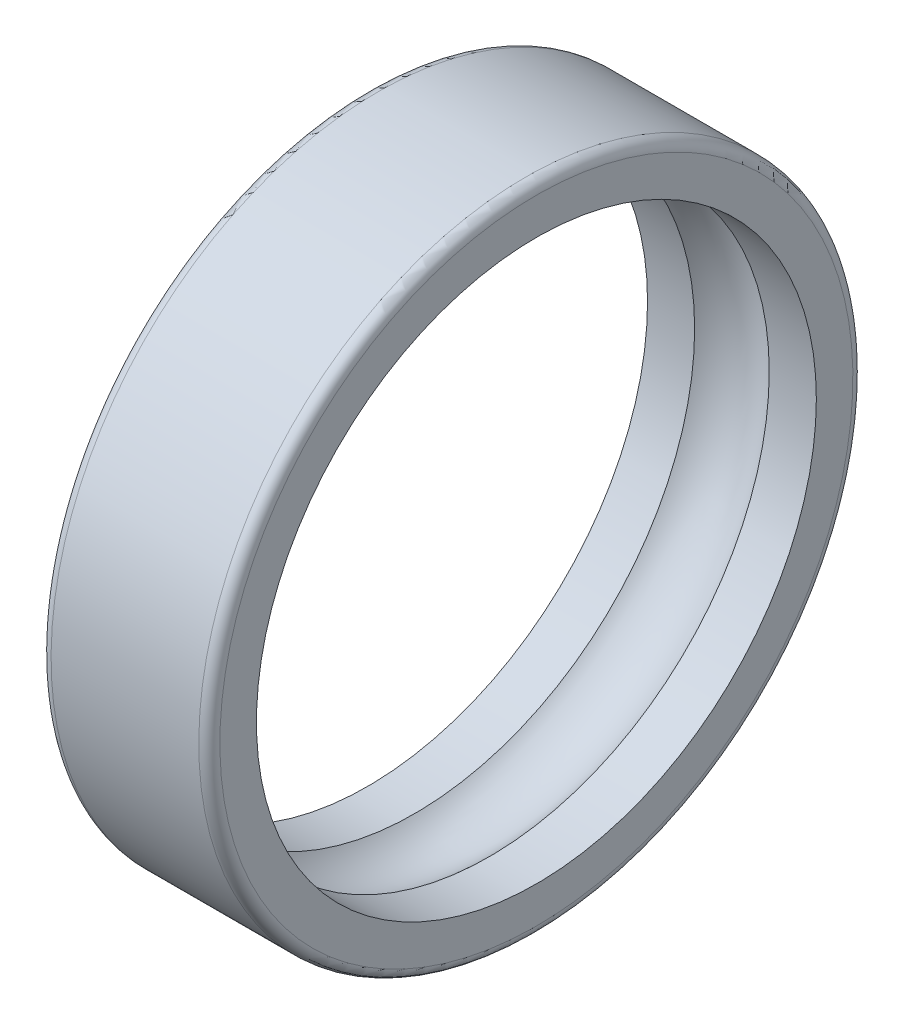
ISO-10303-21;
HEADER;
FILE_DESCRIPTION(('STEP AP214'),'2;1');
FILE_NAME('part.step','',(''),(''),'','','');
FILE_SCHEMA(('AUTOMOTIVE_DESIGN { 1 0 10303 214 1 1 1 1 }'));
ENDSEC;
DATA;
#1=APPLICATION_CONTEXT('core data for automotive mechanical design processes');
#2=APPLICATION_PROTOCOL_DEFINITION('international standard','automotive_design',2000,#1);
#3=PRODUCT_CONTEXT('',#1,'mechanical');
#4=PRODUCT('Part','Part','',(#3));
#5=PRODUCT_RELATED_PRODUCT_CATEGORY('part','',(#4));
#6=PRODUCT_DEFINITION_FORMATION('','',#4);
#7=PRODUCT_DEFINITION_CONTEXT('part definition',#1,'design');
#8=PRODUCT_DEFINITION('design','',#6,#7);
#9=PRODUCT_DEFINITION_SHAPE('','',#8);
#10=(LENGTH_UNIT() NAMED_UNIT(*) SI_UNIT(.MILLI.,.METRE.));
#11=(NAMED_UNIT(*) PLANE_ANGLE_UNIT() SI_UNIT($,.RADIAN.));
#12=(NAMED_UNIT(*) SI_UNIT($,.STERADIAN.) SOLID_ANGLE_UNIT());
#13=UNCERTAINTY_MEASURE_WITH_UNIT(LENGTH_MEASURE(1.E-05),#10,'distance_accuracy_value','');
#14=(GEOMETRIC_REPRESENTATION_CONTEXT(3) GLOBAL_UNCERTAINTY_ASSIGNED_CONTEXT((#13)) GLOBAL_UNIT_ASSIGNED_CONTEXT((#10,
#11,#12)) REPRESENTATION_CONTEXT('',''));
#15=CARTESIAN_POINT('',(0.,0.,0.));
#16=DIRECTION('',(0.,0.,1.));
#17=DIRECTION('',(1.,0.,0.));
#18=AXIS2_PLACEMENT_3D('',#15,#16,#17);
#19=CARTESIAN_POINT('',(25.9943089574791,0.,0.));
#20=DIRECTION('',(-1.,0.,0.));
#21=DIRECTION('',(0.,0.877582561890372,-0.479425538604204));
#22=AXIS2_PLACEMENT_3D('',#19,#20,#21);
#23=TOROIDAL_SURFACE('',#22,23.,5.);
#24=CARTESIAN_POINT('',(22.4587750515691,0.,0.));
#25=DIRECTION('',(1.,0.,0.));
#26=DIRECTION('',(0.,0.,-1.));
#27=AXIS2_PLACEMENT_3D('',#24,#25,#26);
#28=CIRCLE('',#27,26.5355339059);
#29=CARTESIAN_POINT('',(22.4587750515691,0.,-26.5355339059));
#30=VERTEX_POINT('',#29);
#31=EDGE_CURVE('E151',#30,#30,#28,.F.);
#32=ORIENTED_EDGE('',*,*,#31,.T.);
#33=EDGE_LOOP('',(#32));
#34=FACE_BOUND('',#33,.T.);
#35=CARTESIAN_POINT('',(29.5298428634091,0.,0.));
#36=DIRECTION('',(1.,0.,0.));
#37=DIRECTION('',(0.,0.,-1.));
#38=AXIS2_PLACEMENT_3D('',#35,#36,#37);
#39=CIRCLE('',#38,26.5355339059);
#40=CARTESIAN_POINT('',(29.5298428634091,0.,-26.5355339059));
#41=VERTEX_POINT('',#40);
#42=EDGE_CURVE('E148',#41,#41,#39,.T.);
#43=ORIENTED_EDGE('',*,*,#42,.T.);
#44=EDGE_LOOP('',(#43));
#45=FACE_BOUND('',#44,.T.);
#46=ADVANCED_FACE('F17',(#34,#45),#23,.F.);
#47=CARTESIAN_POINT('',(25.9943089573691,0.,0.));
#48=DIRECTION('',(1.,0.,0.));
#49=DIRECTION('',(0.,0.,-1.));
#50=AXIS2_PLACEMENT_3D('',#47,#48,#49);
#51=CYLINDRICAL_SURFACE('',#50,26.5355339059);
#52=CARTESIAN_POINT('',(17.9943089574691,0.,0.));
#53=DIRECTION('',(1.,0.,0.));
#54=DIRECTION('',(0.,0.,-1.));
#55=AXIS2_PLACEMENT_3D('',#52,#53,#54);
#56=CIRCLE('',#55,26.5355339059);
#57=CARTESIAN_POINT('',(17.9943089574691,0.,-26.5355339059));
#58=VERTEX_POINT('',#57);
#59=EDGE_CURVE('E54',#58,#58,#56,.T.);
#60=ORIENTED_EDGE('',*,*,#59,.F.);
#61=EDGE_LOOP('',(#60));
#62=FACE_BOUND('',#61,.T.);
#63=ORIENTED_EDGE('',*,*,#31,.F.);
#64=EDGE_LOOP('',(#63));
#65=FACE_BOUND('',#64,.T.);
#66=ADVANCED_FACE('F85',(#62,#65),#51,.F.);
#67=CARTESIAN_POINT('',(25.9943089573691,0.,0.));
#68=DIRECTION('',(1.,0.,0.));
#69=DIRECTION('',(0.,0.,-1.));
#70=AXIS2_PLACEMENT_3D('',#67,#68,#69);
#71=CYLINDRICAL_SURFACE('',#70,26.5355339059);
#72=ORIENTED_EDGE('',*,*,#42,.F.);
#73=EDGE_LOOP('',(#72));
#74=FACE_BOUND('',#73,.T.);
#75=CARTESIAN_POINT('',(33.9943089574791,0.,0.));
#76=DIRECTION('',(1.,0.,0.));
#77=DIRECTION('',(0.,0.,-1.));
#78=AXIS2_PLACEMENT_3D('',#75,#76,#77);
#79=CIRCLE('',#78,26.5355339059);
#80=CARTESIAN_POINT('',(33.9943089574791,0.,-26.5355339059));
#81=VERTEX_POINT('',#80);
#82=EDGE_CURVE('E60',#81,#81,#79,.T.);
#83=ORIENTED_EDGE('',*,*,#82,.T.);
#84=EDGE_LOOP('',(#83));
#85=FACE_BOUND('',#84,.T.);
#86=ADVANCED_FACE('F79',(#74,#85),#71,.F.);
#87=CARTESIAN_POINT('',(17.9943089574691,30.,0.));
#88=DIRECTION('',(-1.,0.,0.));
#89=DIRECTION('',(0.,0.,1.));
#90=AXIS2_PLACEMENT_3D('',#87,#88,#89);
#91=PLANE('',#90);
#92=ORIENTED_EDGE('',*,*,#59,.T.);
#93=EDGE_LOOP('',(#92));
#94=FACE_BOUND('',#93,.T.);
#95=CARTESIAN_POINT('',(17.9943089574691,0.,0.));
#96=DIRECTION('',(1.,0.,0.));
#97=DIRECTION('',(0.,-0.877582561890572,0.479425538603838));
#98=AXIS2_PLACEMENT_3D('',#95,#96,#97);
#99=CIRCLE('',#98,30.);
#100=CARTESIAN_POINT('',(17.9943089574691,-26.3274768567107,14.3827661581201));
#101=VERTEX_POINT('',#100);
#102=CARTESIAN_POINT('',(17.9943089574691,26.3274768567028,-14.3827661581135));
#103=VERTEX_POINT('',#102);
#104=EDGE_CURVE('E45',#101,#103,#99,.T.);
#105=ORIENTED_EDGE('',*,*,#104,.F.);
#106=CARTESIAN_POINT('',(17.9943089574691,0.,0.));
#107=DIRECTION('',(1.,0.,0.));
#108=DIRECTION('',(0.,0.877582561890373,-0.479425538604203));
#109=AXIS2_PLACEMENT_3D('',#106,#107,#108);
#110=CIRCLE('',#109,29.9999999999888);
#111=EDGE_CURVE('E50',#103,#101,#110,.T.);
#112=ORIENTED_EDGE('',*,*,#111,.F.);
#113=EDGE_LOOP('',(#105,#112));
#114=FACE_BOUND('',#113,.T.);
#115=ADVANCED_FACE('F58',(#94,#114),#91,.T.);
#116=CARTESIAN_POINT('',(33.9943089574791,26.5355339059,0.));
#117=DIRECTION('',(-1.,0.,0.));
#118=DIRECTION('',(0.,0.,1.));
#119=AXIS2_PLACEMENT_3D('',#116,#117,#118);
#120=PLANE('',#119);
#121=ORIENTED_EDGE('',*,*,#82,.F.);
#122=EDGE_LOOP('',(#121));
#123=FACE_BOUND('',#122,.T.);
#124=CARTESIAN_POINT('',(33.9943089574791,0.,0.));
#125=DIRECTION('',(-1.,0.,0.));
#126=DIRECTION('',(0.,0.877582561890372,-0.479425538604204));
#127=AXIS2_PLACEMENT_3D('',#124,#125,#126);
#128=CIRCLE('',#127,30.);
#129=CARTESIAN_POINT('',(33.9943089574791,26.3274768567092,-14.382766158125));
#130=VERTEX_POINT('',#129);
#131=CARTESIAN_POINT('',(33.9943089574791,-26.3274768567105,14.382766158104));
#132=VERTEX_POINT('',#131);
#133=EDGE_CURVE('E35',#130,#132,#128,.T.);
#134=ORIENTED_EDGE('',*,*,#133,.F.);
#135=CARTESIAN_POINT('',(33.9943089574791,0.,0.));
#136=DIRECTION('',(-1.,0.,0.));
#137=DIRECTION('',(0.,-0.877582561890772,0.479425538603472));
#138=AXIS2_PLACEMENT_3D('',#135,#136,#137);
#139=CIRCLE('',#138,29.9999999999888);
#140=EDGE_CURVE('E59',#132,#130,#139,.T.);
#141=ORIENTED_EDGE('',*,*,#140,.F.);
#142=EDGE_LOOP('',(#134,#141));
#143=FACE_BOUND('',#142,.T.);
#144=ADVANCED_FACE('F78',(#123,#143),#120,.F.);
#145=CARTESIAN_POINT('',(18.9943089574691,0.,0.));
#146=DIRECTION('',(-1.,0.,0.));
#147=DIRECTION('',(0.,0.877582561890372,-0.479425538604204));
#148=AXIS2_PLACEMENT_3D('',#145,#146,#147);
#149=TOROIDAL_SURFACE('',#148,30.,1.);
#150=ORIENTED_EDGE('',*,*,#104,.T.);
#151=ORIENTED_EDGE('',*,*,#111,.T.);
#152=EDGE_LOOP('',(#150,#151));
#153=FACE_BOUND('',#152,.T.);
#154=CARTESIAN_POINT('',(18.9943089574691,0.,0.));
#155=DIRECTION('',(1.,0.,0.));
#156=DIRECTION('',(0.,0.,-1.));
#157=AXIS2_PLACEMENT_3D('',#154,#155,#156);
#158=CIRCLE('',#157,31.);
#159=CARTESIAN_POINT('',(18.9943089574691,0.,-31.));
#160=VERTEX_POINT('',#159);
#161=EDGE_CURVE('E29',#160,#160,#158,.T.);
#162=ORIENTED_EDGE('',*,*,#161,.F.);
#163=EDGE_LOOP('',(#162));
#164=FACE_BOUND('',#163,.T.);
#165=ADVANCED_FACE('F48',(#153,#164),#149,.T.);
#166=CARTESIAN_POINT('',(32.9943089574791,0.,0.));
#167=DIRECTION('',(-1.,0.,0.));
#168=DIRECTION('',(0.,0.877582561890372,-0.479425538604204));
#169=AXIS2_PLACEMENT_3D('',#166,#167,#168);
#170=TOROIDAL_SURFACE('',#169,30.,1.);
#171=ORIENTED_EDGE('',*,*,#140,.T.);
#172=ORIENTED_EDGE('',*,*,#133,.T.);
#173=EDGE_LOOP('',(#171,#172));
#174=FACE_BOUND('',#173,.T.);
#175=CARTESIAN_POINT('',(32.9943089574791,0.,0.));
#176=DIRECTION('',(1.,0.,0.));
#177=DIRECTION('',(0.,0.,-1.));
#178=AXIS2_PLACEMENT_3D('',#175,#176,#177);
#179=CIRCLE('',#178,31.);
#180=CARTESIAN_POINT('',(32.9943089574791,0.,-31.));
#181=VERTEX_POINT('',#180);
#182=EDGE_CURVE('E11',#181,#181,#179,.F.);
#183=ORIENTED_EDGE('',*,*,#182,.F.);
#184=EDGE_LOOP('',(#183));
#185=FACE_BOUND('',#184,.T.);
#186=ADVANCED_FACE('F98',(#174,#185),#170,.T.);
#187=CARTESIAN_POINT('',(25.9943089573691,0.,0.));
#188=DIRECTION('',(1.,0.,0.));
#189=DIRECTION('',(0.,0.,-1.));
#190=AXIS2_PLACEMENT_3D('',#187,#188,#189);
#191=CYLINDRICAL_SURFACE('',#190,31.);
#192=ORIENTED_EDGE('',*,*,#161,.T.);
#193=EDGE_LOOP('',(#192));
#194=FACE_BOUND('',#193,.T.);
#195=ORIENTED_EDGE('',*,*,#182,.T.);
#196=EDGE_LOOP('',(#195));
#197=FACE_BOUND('',#196,.T.);
#198=ADVANCED_FACE('F96',(#194,#197),#191,.T.);
#199=CLOSED_SHELL('',(#46,#66,#86,#115,#144,#165,#186,#198));
#200=MANIFOLD_SOLID_BREP('B1',#199);
#201=ADVANCED_BREP_SHAPE_REPRESENTATION('',(#18,#200),#14);
#202=SHAPE_DEFINITION_REPRESENTATION(#9,#201);
ENDSEC;
END-ISO-10303-21;
